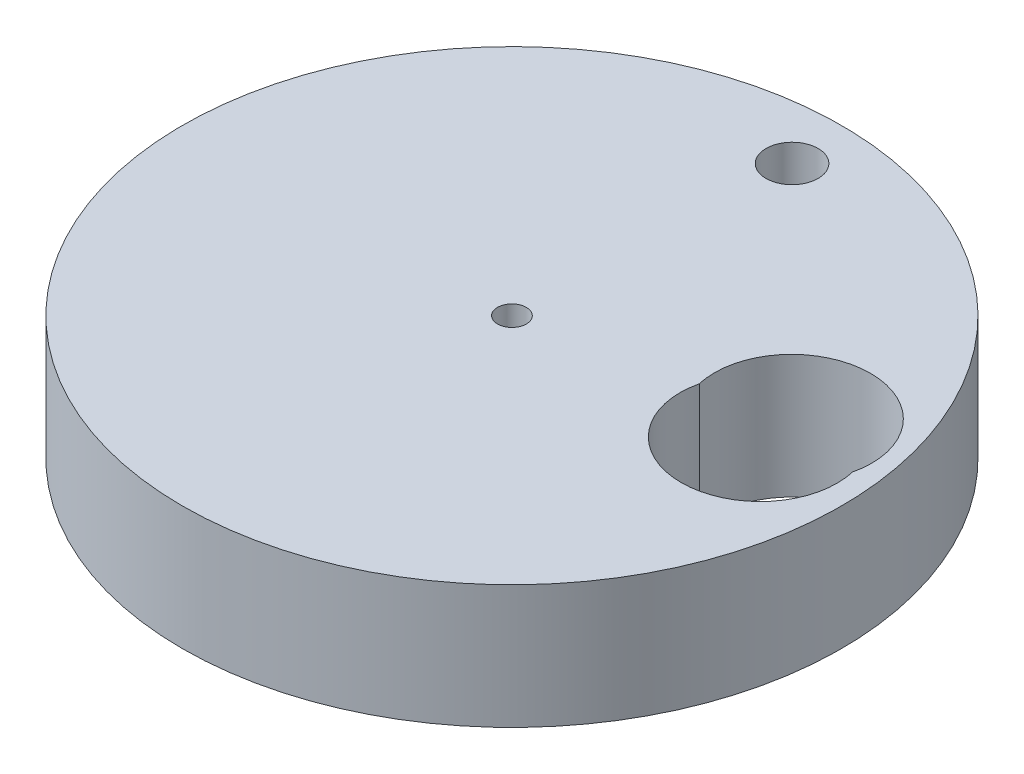
ISO-10303-21;
HEADER;
FILE_DESCRIPTION(('STEP AP214'),'2;1');
FILE_NAME('part.step','',(''),(''),'','','');
FILE_SCHEMA(('AUTOMOTIVE_DESIGN { 1 0 10303 214 1 1 1 1 }'));
ENDSEC;
DATA;
#1=APPLICATION_CONTEXT('core data for automotive mechanical design processes');
#2=APPLICATION_PROTOCOL_DEFINITION('international standard','automotive_design',2000,#1);
#3=PRODUCT_CONTEXT('',#1,'mechanical');
#4=PRODUCT('Part','Part','',(#3));
#5=PRODUCT_RELATED_PRODUCT_CATEGORY('part','',(#4));
#6=PRODUCT_DEFINITION_FORMATION('','',#4);
#7=PRODUCT_DEFINITION_CONTEXT('part definition',#1,'design');
#8=PRODUCT_DEFINITION('design','',#6,#7);
#9=PRODUCT_DEFINITION_SHAPE('','',#8);
#10=(LENGTH_UNIT() NAMED_UNIT(*) SI_UNIT(.MILLI.,.METRE.));
#11=(NAMED_UNIT(*) PLANE_ANGLE_UNIT() SI_UNIT($,.RADIAN.));
#12=(NAMED_UNIT(*) SI_UNIT($,.STERADIAN.) SOLID_ANGLE_UNIT());
#13=UNCERTAINTY_MEASURE_WITH_UNIT(LENGTH_MEASURE(1.E-05),#10,'distance_accuracy_value','');
#14=(GEOMETRIC_REPRESENTATION_CONTEXT(3) GLOBAL_UNCERTAINTY_ASSIGNED_CONTEXT((#13)) GLOBAL_UNIT_ASSIGNED_CONTEXT((#10,
#11,#12)) REPRESENTATION_CONTEXT('',''));
#15=CARTESIAN_POINT('',(0.,0.,0.));
#16=DIRECTION('',(0.,0.,1.));
#17=DIRECTION('',(1.,0.,0.));
#18=AXIS2_PLACEMENT_3D('',#15,#16,#17);
#19=CARTESIAN_POINT('',(35.325,19.05,-2.68035549360249));
#20=DIRECTION('',(0.,1.,0.));
#21=DIRECTION('',(1.,0.,0.));
#22=AXIS2_PLACEMENT_3D('',#19,#20,#21);
#23=ELLIPSE('',#22,12.1,11.9161738114477);
#24=DIRECTION('',(0.,-1.,0.));
#25=VECTOR('',#24,1.);
#26=SURFACE_OF_LINEAR_EXTRUSION('',#23,#25);
#27=CARTESIAN_POINT('',(35.325,0.,-2.68035549360249));
#28=DIRECTION('',(0.,1.,0.));
#29=DIRECTION('',(1.,0.,0.));
#30=AXIS2_PLACEMENT_3D('',#27,#28,#29);
#31=ELLIPSE('',#30,12.1,11.9161738114477);
#32=CARTESIAN_POINT('',(23.5336298493544,0.,-5.35453742967309));
#33=VERTEX_POINT('',#32);
#34=CARTESIAN_POINT('',(47.1163701506455,0.,-5.35453742967318));
#35=VERTEX_POINT('',#34);
#36=EDGE_CURVE('E65',#33,#35,#31,.T.);
#37=ORIENTED_EDGE('',*,*,#36,.F.);
#38=DIRECTION('',(0.,-1.,0.));
#39=VECTOR('',#38,1.);
#40=CARTESIAN_POINT('',(23.5336298493544,19.05,-5.35453742967309));
#41=LINE('',#40,#39);
#42=CARTESIAN_POINT('',(23.5336298493544,19.05,-5.35453742967309));
#43=VERTEX_POINT('',#42);
#44=EDGE_CURVE('E11',#43,#33,#41,.T.);
#45=ORIENTED_EDGE('',*,*,#44,.F.);
#46=CARTESIAN_POINT('',(47.1163701506455,19.05,-5.35453742967318));
#47=VERTEX_POINT('',#46);
#48=EDGE_CURVE('E68',#43,#47,#23,.T.);
#49=ORIENTED_EDGE('',*,*,#48,.T.);
#50=DIRECTION('',(0.,-1.,0.));
#51=VECTOR('',#50,1.);
#52=CARTESIAN_POINT('',(47.1163701506455,19.05,-5.35453742967318));
#53=LINE('',#52,#51);
#54=EDGE_CURVE('E50',#47,#35,#53,.T.);
#55=ORIENTED_EDGE('',*,*,#54,.T.);
#56=EDGE_LOOP('',(#37,#45,#49,#55));
#57=FACE_BOUND('',#56,.T.);
#58=ADVANCED_FACE('F41',(#57),#26,.T.);
#59=CARTESIAN_POINT('',(1.27,19.05,-41.91));
#60=DIRECTION('',(0.,-1.,0.));
#61=DIRECTION('',(0.,0.,-1.));
#62=AXIS2_PLACEMENT_3D('',#59,#60,#61);
#63=CYLINDRICAL_SURFACE('',#62,4.0132);
#64=CARTESIAN_POINT('',(1.27,19.05,-41.91));
#65=DIRECTION('',(0.,1.,0.));
#66=DIRECTION('',(0.,0.,1.));
#67=AXIS2_PLACEMENT_3D('',#64,#65,#66);
#68=CIRCLE('',#67,4.0132);
#69=CARTESIAN_POINT('',(1.27,19.05,-37.8968));
#70=VERTEX_POINT('',#69);
#71=EDGE_CURVE('E175',#70,#70,#68,.T.);
#72=ORIENTED_EDGE('',*,*,#71,.T.);
#73=EDGE_LOOP('',(#72));
#74=FACE_BOUND('',#73,.T.);
#75=CARTESIAN_POINT('',(1.27,0.,-41.91));
#76=DIRECTION('',(0.,1.,0.));
#77=DIRECTION('',(0.,0.,1.));
#78=AXIS2_PLACEMENT_3D('',#75,#76,#77);
#79=CIRCLE('',#78,4.0132);
#80=CARTESIAN_POINT('',(1.27,0.,-37.8968));
#81=VERTEX_POINT('',#80);
#82=EDGE_CURVE('E81',#81,#81,#79,.T.);
#83=ORIENTED_EDGE('',*,*,#82,.F.);
#84=EDGE_LOOP('',(#83));
#85=FACE_BOUND('',#84,.T.);
#86=ADVANCED_FACE('F107',(#74,#85),#63,.F.);
#87=CARTESIAN_POINT('',(0.,19.05,0.));
#88=DIRECTION('',(0.,-1.,0.));
#89=DIRECTION('',(0.,0.,-1.));
#90=AXIS2_PLACEMENT_3D('',#87,#88,#89);
#91=CYLINDRICAL_SURFACE('',#90,2.2225);
#92=CARTESIAN_POINT('',(0.,19.05,0.));
#93=DIRECTION('',(0.,1.,0.));
#94=DIRECTION('',(0.,0.,1.));
#95=AXIS2_PLACEMENT_3D('',#92,#93,#94);
#96=CIRCLE('',#95,2.2225);
#97=CARTESIAN_POINT('',(0.,19.05,2.2225));
#98=VERTEX_POINT('',#97);
#99=EDGE_CURVE('E95',#98,#98,#96,.T.);
#100=ORIENTED_EDGE('',*,*,#99,.T.);
#101=EDGE_LOOP('',(#100));
#102=FACE_BOUND('',#101,.T.);
#103=CARTESIAN_POINT('',(0.,0.,0.));
#104=DIRECTION('',(0.,1.,0.));
#105=DIRECTION('',(0.,0.,1.));
#106=AXIS2_PLACEMENT_3D('',#103,#104,#105);
#107=CIRCLE('',#106,2.2225);
#108=CARTESIAN_POINT('',(0.,0.,2.2225));
#109=VERTEX_POINT('',#108);
#110=EDGE_CURVE('E77',#109,#109,#107,.T.);
#111=ORIENTED_EDGE('',*,*,#110,.F.);
#112=EDGE_LOOP('',(#111));
#113=FACE_BOUND('',#112,.T.);
#114=ADVANCED_FACE('F104',(#102,#113),#91,.F.);
#115=CARTESIAN_POINT('',(35.3249999999999,19.05,-8.02871936574375));
#116=DIRECTION('',(0.,1.,0.));
#117=DIRECTION('',(1.,0.,0.));
#118=AXIS2_PLACEMENT_3D('',#115,#116,#117);
#119=ELLIPSE('',#118,12.1,11.9161738114477);
#120=DIRECTION('',(0.,-1.,0.));
#121=VECTOR('',#120,1.);
#122=SURFACE_OF_LINEAR_EXTRUSION('',#119,#121);
#123=CARTESIAN_POINT('',(35.3249999999999,0.,-8.02871936574375));
#124=DIRECTION('',(0.,1.,0.));
#125=DIRECTION('',(1.,0.,0.));
#126=AXIS2_PLACEMENT_3D('',#123,#124,#125);
#127=ELLIPSE('',#126,12.1,11.9161738114477);
#128=EDGE_CURVE('E74',#35,#33,#127,.T.);
#129=ORIENTED_EDGE('',*,*,#128,.F.);
#130=ORIENTED_EDGE('',*,*,#54,.F.);
#131=EDGE_CURVE('E94',#47,#43,#119,.T.);
#132=ORIENTED_EDGE('',*,*,#131,.T.);
#133=ORIENTED_EDGE('',*,*,#44,.T.);
#134=EDGE_LOOP('',(#129,#130,#132,#133));
#135=FACE_BOUND('',#134,.T.);
#136=ADVANCED_FACE('F76',(#135),#122,.T.);
#137=CARTESIAN_POINT('',(0.,19.05,0.));
#138=DIRECTION('',(0.,-1.,0.));
#139=DIRECTION('',(0.,0.,-1.));
#140=AXIS2_PLACEMENT_3D('',#137,#138,#139);
#141=CYLINDRICAL_SURFACE('',#140,50.8);
#142=CARTESIAN_POINT('',(0.,19.05,0.));
#143=DIRECTION('',(0.,1.,0.));
#144=DIRECTION('',(0.,0.,1.));
#145=AXIS2_PLACEMENT_3D('',#142,#143,#144);
#146=CIRCLE('',#145,50.8);
#147=CARTESIAN_POINT('',(0.,19.05,50.8));
#148=VERTEX_POINT('',#147);
#149=EDGE_CURVE('E70',#148,#148,#146,.T.);
#150=ORIENTED_EDGE('',*,*,#149,.F.);
#151=EDGE_LOOP('',(#150));
#152=FACE_BOUND('',#151,.T.);
#153=CARTESIAN_POINT('',(0.,0.,0.));
#154=DIRECTION('',(0.,1.,0.));
#155=DIRECTION('',(0.,0.,1.));
#156=AXIS2_PLACEMENT_3D('',#153,#154,#155);
#157=CIRCLE('',#156,50.8);
#158=CARTESIAN_POINT('',(0.,0.,50.8));
#159=VERTEX_POINT('',#158);
#160=EDGE_CURVE('E88',#159,#159,#157,.T.);
#161=ORIENTED_EDGE('',*,*,#160,.T.);
#162=EDGE_LOOP('',(#161));
#163=FACE_BOUND('',#162,.T.);
#164=ADVANCED_FACE('F103',(#152,#163),#141,.T.);
#165=CARTESIAN_POINT('',(0.,19.05,0.));
#166=DIRECTION('',(0.,1.,0.));
#167=DIRECTION('',(0.,0.,1.));
#168=AXIS2_PLACEMENT_3D('',#165,#166,#167);
#169=PLANE('',#168);
#170=ORIENTED_EDGE('',*,*,#48,.F.);
#171=ORIENTED_EDGE('',*,*,#131,.F.);
#172=EDGE_LOOP('',(#170,#171));
#173=FACE_BOUND('',#172,.T.);
#174=ORIENTED_EDGE('',*,*,#99,.F.);
#175=EDGE_LOOP('',(#174));
#176=FACE_BOUND('',#175,.T.);
#177=ORIENTED_EDGE('',*,*,#71,.F.);
#178=EDGE_LOOP('',(#177));
#179=FACE_BOUND('',#178,.T.);
#180=ORIENTED_EDGE('',*,*,#149,.T.);
#181=EDGE_LOOP('',(#180));
#182=FACE_BOUND('',#181,.T.);
#183=ADVANCED_FACE('F114',(#173,#176,#179,#182),#169,.T.);
#184=CARTESIAN_POINT('',(0.,0.,0.));
#185=DIRECTION('',(0.,1.,0.));
#186=DIRECTION('',(0.,0.,1.));
#187=AXIS2_PLACEMENT_3D('',#184,#185,#186);
#188=PLANE('',#187);
#189=ORIENTED_EDGE('',*,*,#36,.T.);
#190=ORIENTED_EDGE('',*,*,#128,.T.);
#191=EDGE_LOOP('',(#189,#190));
#192=FACE_BOUND('',#191,.T.);
#193=ORIENTED_EDGE('',*,*,#110,.T.);
#194=EDGE_LOOP('',(#193));
#195=FACE_BOUND('',#194,.T.);
#196=ORIENTED_EDGE('',*,*,#82,.T.);
#197=EDGE_LOOP('',(#196));
#198=FACE_BOUND('',#197,.T.);
#199=ORIENTED_EDGE('',*,*,#160,.F.);
#200=EDGE_LOOP('',(#199));
#201=FACE_BOUND('',#200,.T.);
#202=ADVANCED_FACE('F72',(#192,#195,#198,#201),#188,.F.);
#203=CLOSED_SHELL('',(#58,#86,#114,#136,#164,#183,#202));
#204=MANIFOLD_SOLID_BREP('B2',#203);
#205=ADVANCED_BREP_SHAPE_REPRESENTATION('',(#18,#204),#14);
#206=SHAPE_DEFINITION_REPRESENTATION(#9,#205);
ENDSEC;
END-ISO-10303-21;
